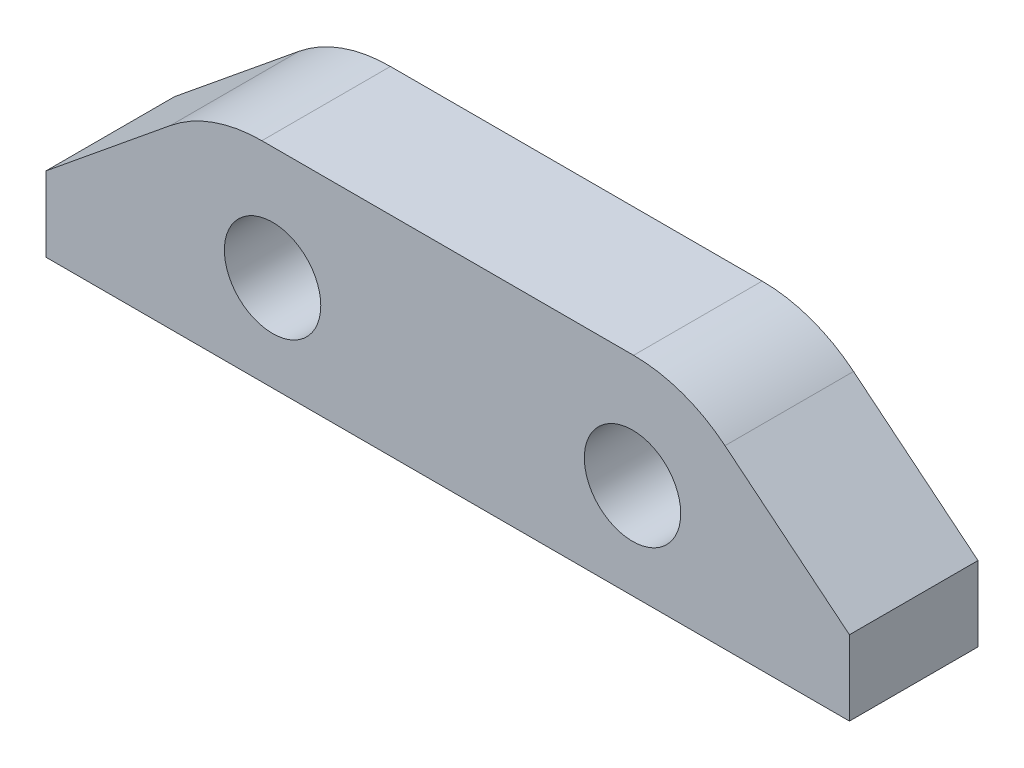
ISO-10303-21;
HEADER;
FILE_DESCRIPTION(('STEP AP214'),'2;1');
FILE_NAME('part.step','',(''),(''),'','','');
FILE_SCHEMA(('AUTOMOTIVE_DESIGN { 1 0 10303 214 1 1 1 1 }'));
ENDSEC;
DATA;
#1=APPLICATION_CONTEXT('core data for automotive mechanical design processes');
#2=APPLICATION_PROTOCOL_DEFINITION('international standard','automotive_design',2000,#1);
#3=PRODUCT_CONTEXT('',#1,'mechanical');
#4=PRODUCT('Part','Part','',(#3));
#5=PRODUCT_RELATED_PRODUCT_CATEGORY('part','',(#4));
#6=PRODUCT_DEFINITION_FORMATION('','',#4);
#7=PRODUCT_DEFINITION_CONTEXT('part definition',#1,'design');
#8=PRODUCT_DEFINITION('design','',#6,#7);
#9=PRODUCT_DEFINITION_SHAPE('','',#8);
#10=(LENGTH_UNIT() NAMED_UNIT(*) SI_UNIT(.MILLI.,.METRE.));
#11=(NAMED_UNIT(*) PLANE_ANGLE_UNIT() SI_UNIT($,.RADIAN.));
#12=(NAMED_UNIT(*) SI_UNIT($,.STERADIAN.) SOLID_ANGLE_UNIT());
#13=UNCERTAINTY_MEASURE_WITH_UNIT(LENGTH_MEASURE(1.E-05),#10,'distance_accuracy_value','');
#14=(GEOMETRIC_REPRESENTATION_CONTEXT(3) GLOBAL_UNCERTAINTY_ASSIGNED_CONTEXT((#13)) GLOBAL_UNIT_ASSIGNED_CONTEXT((#10,
#11,#12)) REPRESENTATION_CONTEXT('',''));
#15=CARTESIAN_POINT('',(0.,0.,0.));
#16=DIRECTION('',(0.,0.,1.));
#17=DIRECTION('',(1.,0.,0.));
#18=AXIS2_PLACEMENT_3D('',#15,#16,#17);
#19=CARTESIAN_POINT('',(18.2833682745344,1.9999993186299,4.));
#20=DIRECTION('',(0.,0.,1.));
#21=DIRECTION('',(1.,0.,0.));
#22=AXIS2_PLACEMENT_3D('',#19,#20,#21);
#23=PLANE('',#22);
#24=CARTESIAN_POINT('',(7.05000297609834,2.96999931862987,4.));
#25=DIRECTION('',(0.,0.,1.));
#26=DIRECTION('',(1.,0.,0.));
#27=AXIS2_PLACEMENT_3D('',#24,#25,#26);
#28=CIRCLE('',#27,1.5);
#29=CARTESIAN_POINT('',(8.55000297609834,2.96999931862987,4.));
#30=VERTEX_POINT('',#29);
#31=EDGE_CURVE('E133',#30,#30,#28,.T.);
#32=ORIENTED_EDGE('',*,*,#31,.F.);
#33=EDGE_LOOP('',(#32));
#34=FACE_BOUND('',#33,.T.);
#35=CARTESIAN_POINT('',(18.2833682745344,1.9999993186299,4.));
#36=DIRECTION('',(0.,0.,1.));
#37=DIRECTION('',(1.,0.,0.));
#38=AXIS2_PLACEMENT_3D('',#35,#36,#37);
#39=CIRCLE('',#38,4.50000000000004);
#40=CARTESIAN_POINT('',(21.1279069060227,5.48691772518478,4.));
#41=VERTEX_POINT('',#40);
#42=CARTESIAN_POINT('',(18.2833682745344,6.4999993186299,4.));
#43=VERTEX_POINT('',#42);
#44=EDGE_CURVE('E144',#41,#43,#39,.T.);
#45=ORIENTED_EDGE('',*,*,#44,.T.);
#46=DIRECTION('',(-1.,0.,0.));
#47=VECTOR('',#46,1.);
#48=CARTESIAN_POINT('',(18.2833682745344,6.4999993186299,4.));
#49=LINE('',#48,#47);
#50=CARTESIAN_POINT('',(6.71663767766303,6.4999993186299,4.));
#51=VERTEX_POINT('',#50);
#52=EDGE_CURVE('E92',#43,#51,#49,.T.);
#53=ORIENTED_EDGE('',*,*,#52,.T.);
#54=CARTESIAN_POINT('',(6.71663767766303,1.9999993186299,4.));
#55=DIRECTION('',(0.,0.,1.));
#56=DIRECTION('',(1.,0.,0.));
#57=AXIS2_PLACEMENT_3D('',#54,#55,#56);
#58=CIRCLE('',#57,4.50000000000005);
#59=CARTESIAN_POINT('',(3.87209904617469,5.48691772518474,4.));
#60=VERTEX_POINT('',#59);
#61=EDGE_CURVE('E159',#51,#60,#58,.T.);
#62=ORIENTED_EDGE('',*,*,#61,.T.);
#63=DIRECTION('',(-0.774870757012193,-0.63211969588627,0.));
#64=VECTOR('',#63,1.);
#65=CARTESIAN_POINT('',(3.87209904617465,5.48691772518478,4.));
#66=LINE('',#65,#64);
#67=CARTESIAN_POINT('',(2.976098699E-06,2.3281610317504,4.));
#68=VERTEX_POINT('',#67);
#69=EDGE_CURVE('E172',#60,#68,#66,.T.);
#70=ORIENTED_EDGE('',*,*,#69,.T.);
#71=DIRECTION('',(0.,-1.,0.));
#72=VECTOR('',#71,1.);
#73=CARTESIAN_POINT('',(2.976098699E-06,-6.813700948E-07,4.));
#74=LINE('',#73,#72);
#75=CARTESIAN_POINT('',(2.976098699E-06,-6.813700948E-07,4.));
#76=VERTEX_POINT('',#75);
#77=EDGE_CURVE('E111',#68,#76,#74,.T.);
#78=ORIENTED_EDGE('',*,*,#77,.T.);
#79=DIRECTION('',(1.,0.,0.));
#80=VECTOR('',#79,1.);
#81=CARTESIAN_POINT('',(2.976098699E-06,-6.813700948E-07,4.));
#82=LINE('',#81,#80);
#83=CARTESIAN_POINT('',(25.0000029760987,-6.813700963E-07,4.));
#84=VERTEX_POINT('',#83);
#85=EDGE_CURVE('E105',#76,#84,#82,.T.);
#86=ORIENTED_EDGE('',*,*,#85,.T.);
#87=DIRECTION('',(0.,1.,0.));
#88=VECTOR('',#87,1.);
#89=CARTESIAN_POINT('',(25.0000029760987,-6.813700963E-07,4.));
#90=LINE('',#89,#88);
#91=CARTESIAN_POINT('',(25.0000029760987,2.32816103175017,4.));
#92=VERTEX_POINT('',#91);
#93=EDGE_CURVE('E109',#84,#92,#90,.T.);
#94=ORIENTED_EDGE('',*,*,#93,.T.);
#95=DIRECTION('',(-0.774870757012174,0.632119695886293,0.));
#96=VECTOR('',#95,1.);
#97=CARTESIAN_POINT('',(25.0000029760987,2.32816103175017,4.));
#98=LINE('',#97,#96);
#99=EDGE_CURVE('E49',#92,#41,#98,.T.);
#100=ORIENTED_EDGE('',*,*,#99,.T.);
#101=EDGE_LOOP('',(#45,#53,#62,#70,#78,#86,#94,#100));
#102=FACE_BOUND('',#101,.T.);
#103=CARTESIAN_POINT('',(18.2500029760982,2.96999931862987,4.));
#104=DIRECTION('',(0.,0.,1.));
#105=DIRECTION('',(1.,0.,0.));
#106=AXIS2_PLACEMENT_3D('',#103,#104,#105);
#107=CIRCLE('',#106,1.5);
#108=CARTESIAN_POINT('',(19.7500029760982,2.96999931862987,4.));
#109=VERTEX_POINT('',#108);
#110=EDGE_CURVE('E181',#109,#109,#107,.T.);
#111=ORIENTED_EDGE('',*,*,#110,.F.);
#112=EDGE_LOOP('',(#111));
#113=FACE_BOUND('',#112,.T.);
#114=ADVANCED_FACE('F32',(#34,#102,#113),#23,.T.);
#115=CARTESIAN_POINT('',(18.2833682745344,1.9999993186299,0.));
#116=DIRECTION('',(0.,0.,1.));
#117=DIRECTION('',(1.,0.,0.));
#118=AXIS2_PLACEMENT_3D('',#115,#116,#117);
#119=PLANE('',#118);
#120=CARTESIAN_POINT('',(7.05000297609834,2.96999931862987,0.));
#121=DIRECTION('',(0.,0.,1.));
#122=DIRECTION('',(1.,0.,0.));
#123=AXIS2_PLACEMENT_3D('',#120,#121,#122);
#124=CIRCLE('',#123,1.5);
#125=CARTESIAN_POINT('',(8.55000297609834,2.96999931862987,0.));
#126=VERTEX_POINT('',#125);
#127=EDGE_CURVE('E178',#126,#126,#124,.T.);
#128=ORIENTED_EDGE('',*,*,#127,.T.);
#129=EDGE_LOOP('',(#128));
#130=FACE_BOUND('',#129,.T.);
#131=CARTESIAN_POINT('',(18.2833682745344,1.9999993186299,0.));
#132=DIRECTION('',(0.,0.,1.));
#133=DIRECTION('',(1.,0.,0.));
#134=AXIS2_PLACEMENT_3D('',#131,#132,#133);
#135=CIRCLE('',#134,4.50000000000004);
#136=CARTESIAN_POINT('',(21.1279069060227,5.48691772518478,0.));
#137=VERTEX_POINT('',#136);
#138=CARTESIAN_POINT('',(18.2833682745344,6.4999993186299,0.));
#139=VERTEX_POINT('',#138);
#140=EDGE_CURVE('E129',#137,#139,#135,.T.);
#141=ORIENTED_EDGE('',*,*,#140,.F.);
#142=DIRECTION('',(-0.774870757012174,0.632119695886293,0.));
#143=VECTOR('',#142,1.);
#144=CARTESIAN_POINT('',(25.0000029760987,2.32816103175017,0.));
#145=LINE('',#144,#143);
#146=CARTESIAN_POINT('',(25.0000029760987,2.32816103175017,0.));
#147=VERTEX_POINT('',#146);
#148=EDGE_CURVE('E84',#147,#137,#145,.T.);
#149=ORIENTED_EDGE('',*,*,#148,.F.);
#150=DIRECTION('',(0.,1.,0.));
#151=VECTOR('',#150,1.);
#152=CARTESIAN_POINT('',(25.0000029760987,-6.813700963E-07,0.));
#153=LINE('',#152,#151);
#154=CARTESIAN_POINT('',(25.0000029760987,-6.813700963E-07,0.));
#155=VERTEX_POINT('',#154);
#156=EDGE_CURVE('E78',#155,#147,#153,.T.);
#157=ORIENTED_EDGE('',*,*,#156,.F.);
#158=DIRECTION('',(1.,0.,0.));
#159=VECTOR('',#158,1.);
#160=CARTESIAN_POINT('',(2.976098699E-06,-6.813700948E-07,0.));
#161=LINE('',#160,#159);
#162=CARTESIAN_POINT('',(2.976098699E-06,-6.813700948E-07,0.));
#163=VERTEX_POINT('',#162);
#164=EDGE_CURVE('E119',#163,#155,#161,.T.);
#165=ORIENTED_EDGE('',*,*,#164,.F.);
#166=DIRECTION('',(0.,-1.,0.));
#167=VECTOR('',#166,1.);
#168=CARTESIAN_POINT('',(2.976098699E-06,-6.813700948E-07,0.));
#169=LINE('',#168,#167);
#170=CARTESIAN_POINT('',(2.976098699E-06,2.3281610317504,0.));
#171=VERTEX_POINT('',#170);
#172=EDGE_CURVE('E139',#171,#163,#169,.T.);
#173=ORIENTED_EDGE('',*,*,#172,.F.);
#174=DIRECTION('',(-0.774870757012193,-0.63211969588627,0.));
#175=VECTOR('',#174,1.);
#176=CARTESIAN_POINT('',(3.87209904617465,5.48691772518478,0.));
#177=LINE('',#176,#175);
#178=CARTESIAN_POINT('',(3.87209904617469,5.48691772518474,0.));
#179=VERTEX_POINT('',#178);
#180=EDGE_CURVE('E137',#179,#171,#177,.T.);
#181=ORIENTED_EDGE('',*,*,#180,.F.);
#182=CARTESIAN_POINT('',(6.71663767766303,1.9999993186299,0.));
#183=DIRECTION('',(0.,0.,1.));
#184=DIRECTION('',(1.,0.,0.));
#185=AXIS2_PLACEMENT_3D('',#182,#183,#184);
#186=CIRCLE('',#185,4.50000000000005);
#187=CARTESIAN_POINT('',(6.71663767766303,6.4999993186299,0.));
#188=VERTEX_POINT('',#187);
#189=EDGE_CURVE('E135',#188,#179,#186,.T.);
#190=ORIENTED_EDGE('',*,*,#189,.F.);
#191=DIRECTION('',(-1.,0.,0.));
#192=VECTOR('',#191,1.);
#193=CARTESIAN_POINT('',(18.2833682745344,6.4999993186299,0.));
#194=LINE('',#193,#192);
#195=EDGE_CURVE('E132',#139,#188,#194,.T.);
#196=ORIENTED_EDGE('',*,*,#195,.F.);
#197=EDGE_LOOP('',(#141,#149,#157,#165,#173,#181,#190,#196));
#198=FACE_BOUND('',#197,.T.);
#199=CARTESIAN_POINT('',(18.2500029760982,2.96999931862987,0.));
#200=DIRECTION('',(0.,0.,1.));
#201=DIRECTION('',(1.,0.,0.));
#202=AXIS2_PLACEMENT_3D('',#199,#200,#201);
#203=CIRCLE('',#202,1.5);
#204=CARTESIAN_POINT('',(19.7500029760982,2.96999931862987,0.));
#205=VERTEX_POINT('',#204);
#206=EDGE_CURVE('E184',#205,#205,#203,.T.);
#207=ORIENTED_EDGE('',*,*,#206,.T.);
#208=EDGE_LOOP('',(#207));
#209=FACE_BOUND('',#208,.T.);
#210=ADVANCED_FACE('F163',(#130,#198,#209),#119,.F.);
#211=CARTESIAN_POINT('',(18.2833682745344,1.9999993186299,4.));
#212=DIRECTION('',(0.,0.,-1.));
#213=DIRECTION('',(-1.,0.,0.));
#214=AXIS2_PLACEMENT_3D('',#211,#212,#213);
#215=CYLINDRICAL_SURFACE('',#214,4.50000000000004);
#216=ORIENTED_EDGE('',*,*,#140,.T.);
#217=DIRECTION('',(0.,0.,-1.));
#218=VECTOR('',#217,1.);
#219=CARTESIAN_POINT('',(18.2833682745344,6.4999993186299,4.));
#220=LINE('',#219,#218);
#221=EDGE_CURVE('E11',#43,#139,#220,.T.);
#222=ORIENTED_EDGE('',*,*,#221,.F.);
#223=ORIENTED_EDGE('',*,*,#44,.F.);
#224=DIRECTION('',(0.,0.,-1.));
#225=VECTOR('',#224,1.);
#226=CARTESIAN_POINT('',(21.1279069060227,5.48691772518478,4.));
#227=LINE('',#226,#225);
#228=EDGE_CURVE('E125',#41,#137,#227,.T.);
#229=ORIENTED_EDGE('',*,*,#228,.T.);
#230=EDGE_LOOP('',(#216,#222,#223,#229));
#231=FACE_BOUND('',#230,.T.);
#232=ADVANCED_FACE('F34',(#231),#215,.T.);
#233=CARTESIAN_POINT('',(18.2833682745344,6.4999993186299,4.));
#234=DIRECTION('',(0.,-1.,0.));
#235=DIRECTION('',(1.,0.,0.));
#236=AXIS2_PLACEMENT_3D('',#233,#234,#235);
#237=PLANE('',#236);
#238=ORIENTED_EDGE('',*,*,#195,.T.);
#239=DIRECTION('',(0.,0.,-1.));
#240=VECTOR('',#239,1.);
#241=CARTESIAN_POINT('',(6.71663767766303,6.4999993186299,4.));
#242=LINE('',#241,#240);
#243=EDGE_CURVE('E41',#51,#188,#242,.T.);
#244=ORIENTED_EDGE('',*,*,#243,.F.);
#245=ORIENTED_EDGE('',*,*,#52,.F.);
#246=ORIENTED_EDGE('',*,*,#221,.T.);
#247=EDGE_LOOP('',(#238,#244,#245,#246));
#248=FACE_BOUND('',#247,.T.);
#249=ADVANCED_FACE('F217',(#248),#237,.F.);
#250=CARTESIAN_POINT('',(6.71663767766303,1.9999993186299,4.));
#251=DIRECTION('',(0.,0.,-1.));
#252=DIRECTION('',(-1.,0.,0.));
#253=AXIS2_PLACEMENT_3D('',#250,#251,#252);
#254=CYLINDRICAL_SURFACE('',#253,4.50000000000005);
#255=ORIENTED_EDGE('',*,*,#189,.T.);
#256=DIRECTION('',(0.,0.,-1.));
#257=VECTOR('',#256,1.);
#258=CARTESIAN_POINT('',(3.87209904617469,5.48691772518474,4.));
#259=LINE('',#258,#257);
#260=EDGE_CURVE('E151',#60,#179,#259,.T.);
#261=ORIENTED_EDGE('',*,*,#260,.F.);
#262=ORIENTED_EDGE('',*,*,#61,.F.);
#263=ORIENTED_EDGE('',*,*,#243,.T.);
#264=EDGE_LOOP('',(#255,#261,#262,#263));
#265=FACE_BOUND('',#264,.T.);
#266=ADVANCED_FACE('F157',(#265),#254,.T.);
#267=CARTESIAN_POINT('',(3.87209904617465,5.48691772518478,4.));
#268=DIRECTION('',(0.63211969588627,-0.774870757012193,0.));
#269=DIRECTION('',(0.774870757012193,0.63211969588627,0.));
#270=AXIS2_PLACEMENT_3D('',#267,#268,#269);
#271=PLANE('',#270);
#272=ORIENTED_EDGE('',*,*,#180,.T.);
#273=DIRECTION('',(0.,0.,-1.));
#274=VECTOR('',#273,1.);
#275=CARTESIAN_POINT('',(2.976098699E-06,2.3281610317504,4.));
#276=LINE('',#275,#274);
#277=EDGE_CURVE('E148',#68,#171,#276,.T.);
#278=ORIENTED_EDGE('',*,*,#277,.F.);
#279=ORIENTED_EDGE('',*,*,#69,.F.);
#280=ORIENTED_EDGE('',*,*,#260,.T.);
#281=EDGE_LOOP('',(#272,#278,#279,#280));
#282=FACE_BOUND('',#281,.T.);
#283=ADVANCED_FACE('F168',(#282),#271,.F.);
#284=CARTESIAN_POINT('',(2.976098699E-06,-6.813700948E-07,4.));
#285=DIRECTION('',(1.,0.,0.));
#286=DIRECTION('',(0.,0.,-1.));
#287=AXIS2_PLACEMENT_3D('',#284,#285,#286);
#288=PLANE('',#287);
#289=ORIENTED_EDGE('',*,*,#172,.T.);
#290=DIRECTION('',(0.,0.,-1.));
#291=VECTOR('',#290,1.);
#292=CARTESIAN_POINT('',(2.976098699E-06,-6.813700948E-07,4.));
#293=LINE('',#292,#291);
#294=EDGE_CURVE('E120',#76,#163,#293,.T.);
#295=ORIENTED_EDGE('',*,*,#294,.F.);
#296=ORIENTED_EDGE('',*,*,#77,.F.);
#297=ORIENTED_EDGE('',*,*,#277,.T.);
#298=EDGE_LOOP('',(#289,#295,#296,#297));
#299=FACE_BOUND('',#298,.T.);
#300=ADVANCED_FACE('F171',(#299),#288,.F.);
#301=CARTESIAN_POINT('',(2.976098699E-06,-6.813700948E-07,4.));
#302=DIRECTION('',(0.,1.,0.));
#303=DIRECTION('',(-1.,0.,0.));
#304=AXIS2_PLACEMENT_3D('',#301,#302,#303);
#305=PLANE('',#304);
#306=ORIENTED_EDGE('',*,*,#164,.T.);
#307=DIRECTION('',(0.,0.,-1.));
#308=VECTOR('',#307,1.);
#309=CARTESIAN_POINT('',(25.0000029760987,-6.813700963E-07,4.));
#310=LINE('',#309,#308);
#311=EDGE_CURVE('E116',#84,#155,#310,.T.);
#312=ORIENTED_EDGE('',*,*,#311,.F.);
#313=ORIENTED_EDGE('',*,*,#85,.F.);
#314=ORIENTED_EDGE('',*,*,#294,.T.);
#315=EDGE_LOOP('',(#306,#312,#313,#314));
#316=FACE_BOUND('',#315,.T.);
#317=ADVANCED_FACE('F117',(#316),#305,.F.);
#318=CARTESIAN_POINT('',(25.0000029760987,-6.813700963E-07,4.));
#319=DIRECTION('',(-1.,0.,0.));
#320=DIRECTION('',(0.,0.,1.));
#321=AXIS2_PLACEMENT_3D('',#318,#319,#320);
#322=PLANE('',#321);
#323=ORIENTED_EDGE('',*,*,#156,.T.);
#324=DIRECTION('',(0.,0.,-1.));
#325=VECTOR('',#324,1.);
#326=CARTESIAN_POINT('',(25.0000029760987,2.32816103175017,4.));
#327=LINE('',#326,#325);
#328=EDGE_CURVE('E121',#92,#147,#327,.T.);
#329=ORIENTED_EDGE('',*,*,#328,.F.);
#330=ORIENTED_EDGE('',*,*,#93,.F.);
#331=ORIENTED_EDGE('',*,*,#311,.T.);
#332=EDGE_LOOP('',(#323,#329,#330,#331));
#333=FACE_BOUND('',#332,.T.);
#334=ADVANCED_FACE('F123',(#333),#322,.F.);
#335=CARTESIAN_POINT('',(25.0000029760987,2.32816103175017,4.));
#336=DIRECTION('',(-0.632119695886293,-0.774870757012174,0.));
#337=DIRECTION('',(0.774870757012174,-0.632119695886293,0.));
#338=AXIS2_PLACEMENT_3D('',#335,#336,#337);
#339=PLANE('',#338);
#340=ORIENTED_EDGE('',*,*,#148,.T.);
#341=ORIENTED_EDGE('',*,*,#228,.F.);
#342=ORIENTED_EDGE('',*,*,#99,.F.);
#343=ORIENTED_EDGE('',*,*,#328,.T.);
#344=EDGE_LOOP('',(#340,#341,#342,#343));
#345=FACE_BOUND('',#344,.T.);
#346=ADVANCED_FACE('F205',(#345),#339,.F.);
#347=CARTESIAN_POINT('',(7.05000297609834,2.96999931862987,4.));
#348=DIRECTION('',(0.,0.,-1.));
#349=DIRECTION('',(-1.,0.,0.));
#350=AXIS2_PLACEMENT_3D('',#347,#348,#349);
#351=CYLINDRICAL_SURFACE('',#350,1.5);
#352=ORIENTED_EDGE('',*,*,#31,.T.);
#353=EDGE_LOOP('',(#352));
#354=FACE_BOUND('',#353,.T.);
#355=ORIENTED_EDGE('',*,*,#127,.F.);
#356=EDGE_LOOP('',(#355));
#357=FACE_BOUND('',#356,.T.);
#358=ADVANCED_FACE('F202',(#354,#357),#351,.F.);
#359=CARTESIAN_POINT('',(18.2500029760982,2.96999931862987,4.));
#360=DIRECTION('',(0.,0.,-1.));
#361=DIRECTION('',(-1.,0.,0.));
#362=AXIS2_PLACEMENT_3D('',#359,#360,#361);
#363=CYLINDRICAL_SURFACE('',#362,1.5);
#364=ORIENTED_EDGE('',*,*,#110,.T.);
#365=EDGE_LOOP('',(#364));
#366=FACE_BOUND('',#365,.T.);
#367=ORIENTED_EDGE('',*,*,#206,.F.);
#368=EDGE_LOOP('',(#367));
#369=FACE_BOUND('',#368,.T.);
#370=ADVANCED_FACE('F190',(#366,#369),#363,.F.);
#371=CLOSED_SHELL('',(#114,#210,#232,#249,#266,#283,#300,#317,#334,#346,#358,#370));
#372=MANIFOLD_SOLID_BREP('B2',#371);
#373=ADVANCED_BREP_SHAPE_REPRESENTATION('',(#18,#372),#14);
#374=SHAPE_DEFINITION_REPRESENTATION(#9,#373);
ENDSEC;
END-ISO-10303-21;
